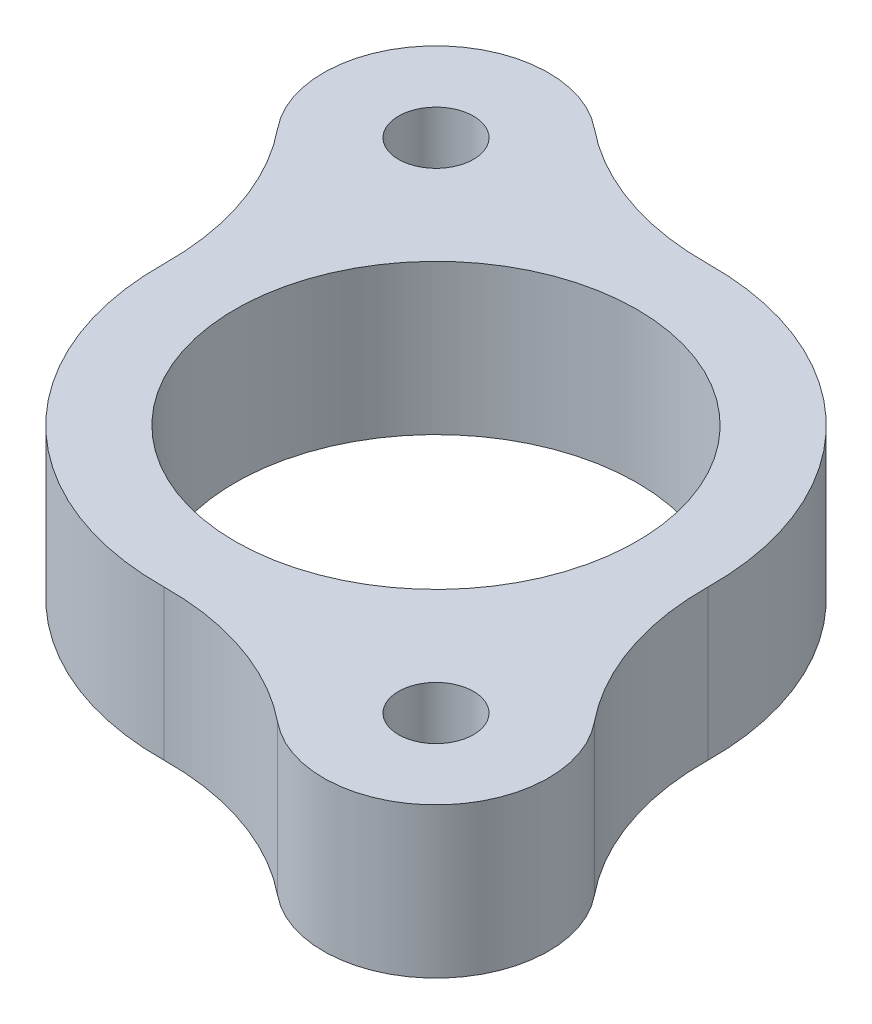
ISO-10303-21;
HEADER;
FILE_DESCRIPTION(('STEP AP214'),'2;1');
FILE_NAME('part.step','',(''),(''),'','','');
FILE_SCHEMA(('AUTOMOTIVE_DESIGN { 1 0 10303 214 1 1 1 1 }'));
ENDSEC;
DATA;
#1=APPLICATION_CONTEXT('core data for automotive mechanical design processes');
#2=APPLICATION_PROTOCOL_DEFINITION('international standard','automotive_design',2000,#1);
#3=PRODUCT_CONTEXT('',#1,'mechanical');
#4=PRODUCT('Part','Part','',(#3));
#5=PRODUCT_RELATED_PRODUCT_CATEGORY('part','',(#4));
#6=PRODUCT_DEFINITION_FORMATION('','',#4);
#7=PRODUCT_DEFINITION_CONTEXT('part definition',#1,'design');
#8=PRODUCT_DEFINITION('design','',#6,#7);
#9=PRODUCT_DEFINITION_SHAPE('','',#8);
#10=(LENGTH_UNIT() NAMED_UNIT(*) SI_UNIT(.MILLI.,.METRE.));
#11=(NAMED_UNIT(*) PLANE_ANGLE_UNIT() SI_UNIT($,.RADIAN.));
#12=(NAMED_UNIT(*) SI_UNIT($,.STERADIAN.) SOLID_ANGLE_UNIT());
#13=UNCERTAINTY_MEASURE_WITH_UNIT(LENGTH_MEASURE(1.E-05),#10,'distance_accuracy_value','');
#14=(GEOMETRIC_REPRESENTATION_CONTEXT(3) GLOBAL_UNCERTAINTY_ASSIGNED_CONTEXT((#13)) GLOBAL_UNIT_ASSIGNED_CONTEXT((#10,
#11,#12)) REPRESENTATION_CONTEXT('',''));
#15=CARTESIAN_POINT('',(0.,0.,0.));
#16=DIRECTION('',(0.,0.,1.));
#17=DIRECTION('',(1.,0.,0.));
#18=AXIS2_PLACEMENT_3D('',#15,#16,#17);
#19=CARTESIAN_POINT('',(3.55,-210.,0.));
#20=DIRECTION('',(0.,1.,0.));
#21=DIRECTION('',(1.,0.,0.));
#22=AXIS2_PLACEMENT_3D('',#19,#20,#21);
#23=PLANE('',#22);
#24=CARTESIAN_POINT('',(0.,-210.,0.));
#25=DIRECTION('',(0.,1.,0.));
#26=DIRECTION('',(0.,0.,1.));
#27=AXIS2_PLACEMENT_3D('',#24,#25,#26);
#28=CIRCLE('',#27,6.696);
#29=CARTESIAN_POINT('',(0.,-210.,6.696));
#30=VERTEX_POINT('',#29);
#31=EDGE_CURVE('E11',#30,#30,#28,.T.);
#32=ORIENTED_EDGE('',*,*,#31,.T.);
#33=EDGE_LOOP('',(#32));
#34=FACE_BOUND('',#33,.T.);
#35=CARTESIAN_POINT('',(0.,-210.,0.));
#36=DIRECTION('',(0.,-1.,0.));
#37=DIRECTION('',(0.,0.,1.));
#38=AXIS2_PLACEMENT_3D('',#35,#36,#37);
#39=CIRCLE('',#38,9.196);
#40=CARTESIAN_POINT('',(0.130407254761741,-210.,9.19507530952877));
#41=VERTEX_POINT('',#40);
#42=CARTESIAN_POINT('',(-9.19507530952876,-210.,-0.130407254761735));
#43=VERTEX_POINT('',#42);
#44=EDGE_CURVE('E160',#41,#43,#39,.T.);
#45=ORIENTED_EDGE('',*,*,#44,.T.);
#46=CARTESIAN_POINT('',(-18.1941703275539,-210.,-0.258035059552472));
#47=DIRECTION('',(0.,1.,0.));
#48=DIRECTION('',(0.,0.,1.));
#49=AXIS2_PLACEMENT_3D('',#46,#47,#48);
#50=CIRCLE('',#49,9.);
#51=CARTESIAN_POINT('',(-11.2110620571371,-210.,-5.93572815478372));
#52=VERTEX_POINT('',#51);
#53=EDGE_CURVE('E126',#43,#52,#50,.T.);
#54=ORIENTED_EDGE('',*,*,#53,.T.);
#55=CARTESIAN_POINT('',(-8.30143361113007,-210.,-8.30143361113007));
#56=DIRECTION('',(0.,1.,0.));
#57=DIRECTION('',(0.,0.,1.));
#58=AXIS2_PLACEMENT_3D('',#55,#56,#57);
#59=CIRCLE('',#58,3.75);
#60=CARTESIAN_POINT('',(-5.93572815478373,-210.,-11.2110620571371));
#61=VERTEX_POINT('',#60);
#62=EDGE_CURVE('E141',#61,#52,#59,.T.);
#63=ORIENTED_EDGE('',*,*,#62,.F.);
#64=CARTESIAN_POINT('',(-0.258035059552484,-210.,-18.1941703275539));
#65=DIRECTION('',(0.,-1.,0.));
#66=DIRECTION('',(0.,0.,1.));
#67=AXIS2_PLACEMENT_3D('',#64,#65,#66);
#68=CIRCLE('',#67,9.);
#69=CARTESIAN_POINT('',(-0.130407254761742,-210.,-9.19507530952877));
#70=VERTEX_POINT('',#69);
#71=EDGE_CURVE('E153',#70,#61,#68,.T.);
#72=ORIENTED_EDGE('',*,*,#71,.F.);
#73=CARTESIAN_POINT('',(0.,-210.,0.));
#74=DIRECTION('',(0.,-1.,0.));
#75=DIRECTION('',(0.,0.,1.));
#76=AXIS2_PLACEMENT_3D('',#73,#74,#75);
#77=CIRCLE('',#76,9.196);
#78=CARTESIAN_POINT('',(9.19507530952877,-210.,0.130407254761737));
#79=VERTEX_POINT('',#78);
#80=EDGE_CURVE('E206',#70,#79,#77,.T.);
#81=ORIENTED_EDGE('',*,*,#80,.T.);
#82=CARTESIAN_POINT('',(18.1941703275539,-210.,0.258035059552481));
#83=DIRECTION('',(0.,1.,0.));
#84=DIRECTION('',(0.,0.,1.));
#85=AXIS2_PLACEMENT_3D('',#82,#83,#84);
#86=CIRCLE('',#85,9.);
#87=CARTESIAN_POINT('',(11.2110620571371,-210.,5.93572815478372));
#88=VERTEX_POINT('',#87);
#89=EDGE_CURVE('E193',#79,#88,#86,.T.);
#90=ORIENTED_EDGE('',*,*,#89,.T.);
#91=CARTESIAN_POINT('',(8.30143361113007,-210.,8.30143361113007));
#92=DIRECTION('',(0.,1.,0.));
#93=DIRECTION('',(0.,0.,1.));
#94=AXIS2_PLACEMENT_3D('',#91,#92,#93);
#95=CIRCLE('',#94,3.75);
#96=CARTESIAN_POINT('',(5.93572815478373,-210.,11.2110620571371));
#97=VERTEX_POINT('',#96);
#98=EDGE_CURVE('E167',#97,#88,#95,.T.);
#99=ORIENTED_EDGE('',*,*,#98,.F.);
#100=CARTESIAN_POINT('',(0.258035059552483,-210.,18.1941703275539));
#101=DIRECTION('',(0.,-1.,0.));
#102=DIRECTION('',(0.,0.,1.));
#103=AXIS2_PLACEMENT_3D('',#100,#101,#102);
#104=CIRCLE('',#103,9.);
#105=EDGE_CURVE('E188',#41,#97,#104,.T.);
#106=ORIENTED_EDGE('',*,*,#105,.F.);
#107=EDGE_LOOP('',(#45,#54,#63,#72,#81,#90,#99,#106));
#108=FACE_BOUND('',#107,.T.);
#109=CARTESIAN_POINT('',(8.30143361113007,-210.,8.30143361113007));
#110=DIRECTION('',(0.,1.,0.));
#111=DIRECTION('',(0.,0.,1.));
#112=AXIS2_PLACEMENT_3D('',#109,#110,#111);
#113=CIRCLE('',#112,1.25);
#114=CARTESIAN_POINT('',(8.30143361113007,-210.,9.55143361113007));
#115=VERTEX_POINT('',#114);
#116=EDGE_CURVE('E197',#115,#115,#113,.T.);
#117=ORIENTED_EDGE('',*,*,#116,.T.);
#118=EDGE_LOOP('',(#117));
#119=FACE_BOUND('',#118,.T.);
#120=CARTESIAN_POINT('',(-8.30143361113007,-210.,-8.30143361113007));
#121=DIRECTION('',(0.,1.,0.));
#122=DIRECTION('',(0.,0.,1.));
#123=AXIS2_PLACEMENT_3D('',#120,#121,#122);
#124=CIRCLE('',#123,1.25);
#125=CARTESIAN_POINT('',(-8.30143361113007,-210.,-7.05143361113007));
#126=VERTEX_POINT('',#125);
#127=EDGE_CURVE('E183',#126,#126,#124,.T.);
#128=ORIENTED_EDGE('',*,*,#127,.T.);
#129=EDGE_LOOP('',(#128));
#130=FACE_BOUND('',#129,.T.);
#131=ADVANCED_FACE('F17',(#34,#108,#119,#130),#23,.F.);
#132=CARTESIAN_POINT('',(3.55,-205.,0.));
#133=DIRECTION('',(0.,1.,0.));
#134=DIRECTION('',(1.,0.,0.));
#135=AXIS2_PLACEMENT_3D('',#132,#133,#134);
#136=PLANE('',#135);
#137=CARTESIAN_POINT('',(0.,-205.,0.));
#138=DIRECTION('',(0.,1.,0.));
#139=DIRECTION('',(0.,0.,1.));
#140=AXIS2_PLACEMENT_3D('',#137,#138,#139);
#141=CIRCLE('',#140,6.696);
#142=CARTESIAN_POINT('',(0.,-205.,6.696));
#143=VERTEX_POINT('',#142);
#144=EDGE_CURVE('E28',#143,#143,#141,.T.);
#145=ORIENTED_EDGE('',*,*,#144,.F.);
#146=EDGE_LOOP('',(#145));
#147=FACE_BOUND('',#146,.T.);
#148=CARTESIAN_POINT('',(0.,-205.,0.));
#149=DIRECTION('',(0.,-1.,0.));
#150=DIRECTION('',(0.,0.,1.));
#151=AXIS2_PLACEMENT_3D('',#148,#149,#150);
#152=CIRCLE('',#151,9.196);
#153=CARTESIAN_POINT('',(0.130407254761741,-205.,9.19507530952877));
#154=VERTEX_POINT('',#153);
#155=CARTESIAN_POINT('',(-9.19507530952876,-205.,-0.130407254761735));
#156=VERTEX_POINT('',#155);
#157=EDGE_CURVE('E159',#154,#156,#152,.T.);
#158=ORIENTED_EDGE('',*,*,#157,.F.);
#159=CARTESIAN_POINT('',(0.258035059552483,-205.,18.1941703275539));
#160=DIRECTION('',(0.,-1.,0.));
#161=DIRECTION('',(0.,0.,1.));
#162=AXIS2_PLACEMENT_3D('',#159,#160,#161);
#163=CIRCLE('',#162,9.);
#164=CARTESIAN_POINT('',(5.93572815478373,-205.,11.2110620571371));
#165=VERTEX_POINT('',#164);
#166=EDGE_CURVE('E163',#154,#165,#163,.T.);
#167=ORIENTED_EDGE('',*,*,#166,.T.);
#168=CARTESIAN_POINT('',(8.30143361113007,-205.,8.30143361113007));
#169=DIRECTION('',(0.,1.,0.));
#170=DIRECTION('',(0.,0.,1.));
#171=AXIS2_PLACEMENT_3D('',#168,#169,#170);
#172=CIRCLE('',#171,3.75);
#173=CARTESIAN_POINT('',(11.2110620571371,-205.,5.93572815478372));
#174=VERTEX_POINT('',#173);
#175=EDGE_CURVE('E189',#165,#174,#172,.T.);
#176=ORIENTED_EDGE('',*,*,#175,.T.);
#177=CARTESIAN_POINT('',(18.1941703275539,-205.,0.258035059552481));
#178=DIRECTION('',(0.,1.,0.));
#179=DIRECTION('',(0.,0.,1.));
#180=AXIS2_PLACEMENT_3D('',#177,#178,#179);
#181=CIRCLE('',#180,9.);
#182=CARTESIAN_POINT('',(9.19507530952877,-205.,0.130407254761737));
#183=VERTEX_POINT('',#182);
#184=EDGE_CURVE('E249',#183,#174,#181,.T.);
#185=ORIENTED_EDGE('',*,*,#184,.F.);
#186=CARTESIAN_POINT('',(0.,-205.,0.));
#187=DIRECTION('',(0.,-1.,0.));
#188=DIRECTION('',(0.,0.,1.));
#189=AXIS2_PLACEMENT_3D('',#186,#187,#188);
#190=CIRCLE('',#189,9.196);
#191=CARTESIAN_POINT('',(-0.130407254761742,-205.,-9.19507530952877));
#192=VERTEX_POINT('',#191);
#193=EDGE_CURVE('E151',#192,#183,#190,.T.);
#194=ORIENTED_EDGE('',*,*,#193,.F.);
#195=CARTESIAN_POINT('',(-0.258035059552484,-205.,-18.1941703275539));
#196=DIRECTION('',(0.,-1.,0.));
#197=DIRECTION('',(0.,0.,1.));
#198=AXIS2_PLACEMENT_3D('',#195,#196,#197);
#199=CIRCLE('',#198,9.);
#200=CARTESIAN_POINT('',(-5.93572815478373,-205.,-11.2110620571371));
#201=VERTEX_POINT('',#200);
#202=EDGE_CURVE('E134',#192,#201,#199,.T.);
#203=ORIENTED_EDGE('',*,*,#202,.T.);
#204=CARTESIAN_POINT('',(-8.30143361113007,-205.,-8.30143361113007));
#205=DIRECTION('',(0.,1.,0.));
#206=DIRECTION('',(0.,0.,1.));
#207=AXIS2_PLACEMENT_3D('',#204,#205,#206);
#208=CIRCLE('',#207,3.75);
#209=CARTESIAN_POINT('',(-11.2110620571371,-205.,-5.93572815478372));
#210=VERTEX_POINT('',#209);
#211=EDGE_CURVE('E130',#201,#210,#208,.T.);
#212=ORIENTED_EDGE('',*,*,#211,.T.);
#213=CARTESIAN_POINT('',(-18.1941703275539,-205.,-0.258035059552472));
#214=DIRECTION('',(0.,1.,0.));
#215=DIRECTION('',(0.,0.,1.));
#216=AXIS2_PLACEMENT_3D('',#213,#214,#215);
#217=CIRCLE('',#216,9.);
#218=EDGE_CURVE('E114',#156,#210,#217,.T.);
#219=ORIENTED_EDGE('',*,*,#218,.F.);
#220=EDGE_LOOP('',(#158,#167,#176,#185,#194,#203,#212,#219));
#221=FACE_BOUND('',#220,.T.);
#222=CARTESIAN_POINT('',(8.30143361113007,-205.,8.30143361113007));
#223=DIRECTION('',(0.,1.,0.));
#224=DIRECTION('',(0.,0.,1.));
#225=AXIS2_PLACEMENT_3D('',#222,#223,#224);
#226=CIRCLE('',#225,1.25);
#227=CARTESIAN_POINT('',(8.30143361113007,-205.,9.55143361113007));
#228=VERTEX_POINT('',#227);
#229=EDGE_CURVE('E125',#228,#228,#226,.T.);
#230=ORIENTED_EDGE('',*,*,#229,.F.);
#231=EDGE_LOOP('',(#230));
#232=FACE_BOUND('',#231,.T.);
#233=CARTESIAN_POINT('',(-8.30143361113007,-205.,-8.30143361113007));
#234=DIRECTION('',(0.,1.,0.));
#235=DIRECTION('',(0.,0.,1.));
#236=AXIS2_PLACEMENT_3D('',#233,#234,#235);
#237=CIRCLE('',#236,1.25);
#238=CARTESIAN_POINT('',(-8.30143361113007,-205.,-7.05143361113007));
#239=VERTEX_POINT('',#238);
#240=EDGE_CURVE('E185',#239,#239,#237,.T.);
#241=ORIENTED_EDGE('',*,*,#240,.F.);
#242=EDGE_LOOP('',(#241));
#243=FACE_BOUND('',#242,.T.);
#244=ADVANCED_FACE('F131',(#147,#221,#232,#243),#136,.T.);
#245=CARTESIAN_POINT('',(0.,-205.,0.));
#246=DIRECTION('',(0.,-1.,0.));
#247=DIRECTION('',(0.,0.,-1.));
#248=AXIS2_PLACEMENT_3D('',#245,#246,#247);
#249=CYLINDRICAL_SURFACE('',#248,6.696);
#250=ORIENTED_EDGE('',*,*,#31,.F.);
#251=EDGE_LOOP('',(#250));
#252=FACE_BOUND('',#251,.T.);
#253=ORIENTED_EDGE('',*,*,#144,.T.);
#254=EDGE_LOOP('',(#253));
#255=FACE_BOUND('',#254,.T.);
#256=ADVANCED_FACE('F211',(#252,#255),#249,.F.);
#257=CARTESIAN_POINT('',(-8.30143361113007,-205.,-8.30143361113007));
#258=DIRECTION('',(0.,-1.,0.));
#259=DIRECTION('',(0.,0.,-1.));
#260=AXIS2_PLACEMENT_3D('',#257,#258,#259);
#261=CYLINDRICAL_SURFACE('',#260,1.25);
#262=ORIENTED_EDGE('',*,*,#127,.F.);
#263=EDGE_LOOP('',(#262));
#264=FACE_BOUND('',#263,.T.);
#265=ORIENTED_EDGE('',*,*,#240,.T.);
#266=EDGE_LOOP('',(#265));
#267=FACE_BOUND('',#266,.T.);
#268=ADVANCED_FACE('F220',(#264,#267),#261,.F.);
#269=CARTESIAN_POINT('',(8.30143361113007,-205.,8.30143361113007));
#270=DIRECTION('',(0.,-1.,0.));
#271=DIRECTION('',(0.,0.,-1.));
#272=AXIS2_PLACEMENT_3D('',#269,#270,#271);
#273=CYLINDRICAL_SURFACE('',#272,1.25);
#274=ORIENTED_EDGE('',*,*,#116,.F.);
#275=EDGE_LOOP('',(#274));
#276=FACE_BOUND('',#275,.T.);
#277=ORIENTED_EDGE('',*,*,#229,.T.);
#278=EDGE_LOOP('',(#277));
#279=FACE_BOUND('',#278,.T.);
#280=ADVANCED_FACE('F225',(#276,#279),#273,.F.);
#281=CARTESIAN_POINT('',(-18.1941703275539,-205.,-0.258035059552472));
#282=DIRECTION('',(0.,-1.,0.));
#283=DIRECTION('',(0.,0.,-1.));
#284=AXIS2_PLACEMENT_3D('',#281,#282,#283);
#285=CYLINDRICAL_SURFACE('',#284,9.);
#286=ORIENTED_EDGE('',*,*,#53,.F.);
#287=DIRECTION('',(0.,-1.,0.));
#288=VECTOR('',#287,1.);
#289=CARTESIAN_POINT('',(-9.19507530952876,-205.,-0.130407254761735));
#290=LINE('',#289,#288);
#291=EDGE_CURVE('E120',#156,#43,#290,.T.);
#292=ORIENTED_EDGE('',*,*,#291,.F.);
#293=ORIENTED_EDGE('',*,*,#218,.T.);
#294=DIRECTION('',(0.,-1.,0.));
#295=VECTOR('',#294,1.);
#296=CARTESIAN_POINT('',(-11.2110620571371,-205.,-5.93572815478372));
#297=LINE('',#296,#295);
#298=EDGE_CURVE('E117',#210,#52,#297,.T.);
#299=ORIENTED_EDGE('',*,*,#298,.T.);
#300=EDGE_LOOP('',(#286,#292,#293,#299));
#301=FACE_BOUND('',#300,.T.);
#302=ADVANCED_FACE('F19',(#301),#285,.F.);
#303=CARTESIAN_POINT('',(-8.30143361113007,-205.,-8.30143361113007));
#304=DIRECTION('',(0.,-1.,0.));
#305=DIRECTION('',(0.,0.,-1.));
#306=AXIS2_PLACEMENT_3D('',#303,#304,#305);
#307=CYLINDRICAL_SURFACE('',#306,3.75);
#308=ORIENTED_EDGE('',*,*,#62,.T.);
#309=ORIENTED_EDGE('',*,*,#298,.F.);
#310=ORIENTED_EDGE('',*,*,#211,.F.);
#311=DIRECTION('',(0.,-1.,0.));
#312=VECTOR('',#311,1.);
#313=CARTESIAN_POINT('',(-5.93572815478373,-205.,-11.2110620571371));
#314=LINE('',#313,#312);
#315=EDGE_CURVE('E169',#201,#61,#314,.T.);
#316=ORIENTED_EDGE('',*,*,#315,.T.);
#317=EDGE_LOOP('',(#308,#309,#310,#316));
#318=FACE_BOUND('',#317,.T.);
#319=ADVANCED_FACE('F140',(#318),#307,.T.);
#320=CARTESIAN_POINT('',(-0.258035059552484,-205.,-18.1941703275539));
#321=DIRECTION('',(0.,-1.,0.));
#322=DIRECTION('',(0.,0.,-1.));
#323=AXIS2_PLACEMENT_3D('',#320,#321,#322);
#324=CYLINDRICAL_SURFACE('',#323,9.);
#325=ORIENTED_EDGE('',*,*,#71,.T.);
#326=ORIENTED_EDGE('',*,*,#315,.F.);
#327=ORIENTED_EDGE('',*,*,#202,.F.);
#328=DIRECTION('',(0.,-1.,0.));
#329=VECTOR('',#328,1.);
#330=CARTESIAN_POINT('',(-0.130407254761742,-205.,-9.19507530952877));
#331=LINE('',#330,#329);
#332=EDGE_CURVE('E154',#192,#70,#331,.T.);
#333=ORIENTED_EDGE('',*,*,#332,.T.);
#334=EDGE_LOOP('',(#325,#326,#327,#333));
#335=FACE_BOUND('',#334,.T.);
#336=ADVANCED_FACE('F230',(#335),#324,.F.);
#337=CARTESIAN_POINT('',(0.,-205.,0.));
#338=DIRECTION('',(0.,-1.,0.));
#339=DIRECTION('',(0.,0.,-1.));
#340=AXIS2_PLACEMENT_3D('',#337,#338,#339);
#341=CYLINDRICAL_SURFACE('',#340,9.196);
#342=ORIENTED_EDGE('',*,*,#80,.F.);
#343=ORIENTED_EDGE('',*,*,#332,.F.);
#344=ORIENTED_EDGE('',*,*,#193,.T.);
#345=DIRECTION('',(0.,-1.,0.));
#346=VECTOR('',#345,1.);
#347=CARTESIAN_POINT('',(9.19507530952877,-205.,0.130407254761737));
#348=LINE('',#347,#346);
#349=EDGE_CURVE('E245',#183,#79,#348,.T.);
#350=ORIENTED_EDGE('',*,*,#349,.T.);
#351=EDGE_LOOP('',(#342,#343,#344,#350));
#352=FACE_BOUND('',#351,.T.);
#353=ADVANCED_FACE('F227',(#352),#341,.T.);
#354=CARTESIAN_POINT('',(18.1941703275539,-205.,0.258035059552481));
#355=DIRECTION('',(0.,-1.,0.));
#356=DIRECTION('',(0.,0.,-1.));
#357=AXIS2_PLACEMENT_3D('',#354,#355,#356);
#358=CYLINDRICAL_SURFACE('',#357,9.);
#359=ORIENTED_EDGE('',*,*,#89,.F.);
#360=ORIENTED_EDGE('',*,*,#349,.F.);
#361=ORIENTED_EDGE('',*,*,#184,.T.);
#362=DIRECTION('',(0.,-1.,0.));
#363=VECTOR('',#362,1.);
#364=CARTESIAN_POINT('',(11.2110620571371,-205.,5.93572815478372));
#365=LINE('',#364,#363);
#366=EDGE_CURVE('E181',#174,#88,#365,.T.);
#367=ORIENTED_EDGE('',*,*,#366,.T.);
#368=EDGE_LOOP('',(#359,#360,#361,#367));
#369=FACE_BOUND('',#368,.T.);
#370=ADVANCED_FACE('F229',(#369),#358,.F.);
#371=CARTESIAN_POINT('',(8.30143361113007,-205.,8.30143361113007));
#372=DIRECTION('',(0.,-1.,0.));
#373=DIRECTION('',(0.,0.,-1.));
#374=AXIS2_PLACEMENT_3D('',#371,#372,#373);
#375=CYLINDRICAL_SURFACE('',#374,3.75);
#376=ORIENTED_EDGE('',*,*,#98,.T.);
#377=ORIENTED_EDGE('',*,*,#366,.F.);
#378=ORIENTED_EDGE('',*,*,#175,.F.);
#379=DIRECTION('',(0.,-1.,0.));
#380=VECTOR('',#379,1.);
#381=CARTESIAN_POINT('',(5.93572815478373,-205.,11.2110620571371));
#382=LINE('',#381,#380);
#383=EDGE_CURVE('E21',#165,#97,#382,.T.);
#384=ORIENTED_EDGE('',*,*,#383,.T.);
#385=EDGE_LOOP('',(#376,#377,#378,#384));
#386=FACE_BOUND('',#385,.T.);
#387=ADVANCED_FACE('F236',(#386),#375,.T.);
#388=CARTESIAN_POINT('',(0.258035059552483,-205.,18.1941703275539));
#389=DIRECTION('',(0.,-1.,0.));
#390=DIRECTION('',(0.,0.,-1.));
#391=AXIS2_PLACEMENT_3D('',#388,#389,#390);
#392=CYLINDRICAL_SURFACE('',#391,9.);
#393=ORIENTED_EDGE('',*,*,#105,.T.);
#394=ORIENTED_EDGE('',*,*,#383,.F.);
#395=ORIENTED_EDGE('',*,*,#166,.F.);
#396=DIRECTION('',(0.,-1.,0.));
#397=VECTOR('',#396,1.);
#398=CARTESIAN_POINT('',(0.130407254761741,-205.,9.19507530952877));
#399=LINE('',#398,#397);
#400=EDGE_CURVE('E155',#154,#41,#399,.T.);
#401=ORIENTED_EDGE('',*,*,#400,.T.);
#402=EDGE_LOOP('',(#393,#394,#395,#401));
#403=FACE_BOUND('',#402,.T.);
#404=ADVANCED_FACE('F273',(#403),#392,.F.);
#405=CARTESIAN_POINT('',(0.,-205.,0.));
#406=DIRECTION('',(0.,-1.,0.));
#407=DIRECTION('',(0.,0.,-1.));
#408=AXIS2_PLACEMENT_3D('',#405,#406,#407);
#409=CYLINDRICAL_SURFACE('',#408,9.196);
#410=ORIENTED_EDGE('',*,*,#44,.F.);
#411=ORIENTED_EDGE('',*,*,#400,.F.);
#412=ORIENTED_EDGE('',*,*,#157,.T.);
#413=ORIENTED_EDGE('',*,*,#291,.T.);
#414=EDGE_LOOP('',(#410,#411,#412,#413));
#415=FACE_BOUND('',#414,.T.);
#416=ADVANCED_FACE('F276',(#415),#409,.T.);
#417=CLOSED_SHELL('',(#131,#244,#256,#268,#280,#302,#319,#336,#353,#370,#387,#404,#416));
#418=MANIFOLD_SOLID_BREP('B1',#417);
#419=ADVANCED_BREP_SHAPE_REPRESENTATION('',(#18,#418),#14);
#420=SHAPE_DEFINITION_REPRESENTATION(#9,#419);
ENDSEC;
END-ISO-10303-21;
